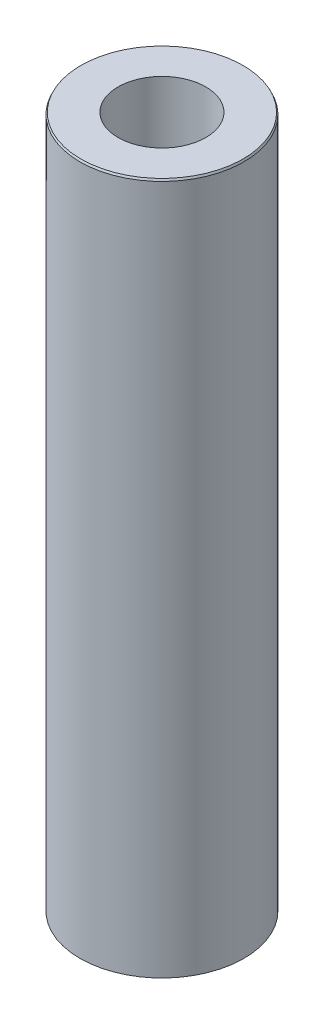
ISO-10303-21;
HEADER;
FILE_DESCRIPTION(('STEP AP214'),'2;1');
FILE_NAME('part.step','',(''),(''),'','','');
FILE_SCHEMA(('AUTOMOTIVE_DESIGN { 1 0 10303 214 1 1 1 1 }'));
ENDSEC;
DATA;
#1=APPLICATION_CONTEXT('core data for automotive mechanical design processes');
#2=APPLICATION_PROTOCOL_DEFINITION('international standard','automotive_design',2000,#1);
#3=PRODUCT_CONTEXT('',#1,'mechanical');
#4=PRODUCT('Part','Part','',(#3));
#5=PRODUCT_RELATED_PRODUCT_CATEGORY('part','',(#4));
#6=PRODUCT_DEFINITION_FORMATION('','',#4);
#7=PRODUCT_DEFINITION_CONTEXT('part definition',#1,'design');
#8=PRODUCT_DEFINITION('design','',#6,#7);
#9=PRODUCT_DEFINITION_SHAPE('','',#8);
#10=(LENGTH_UNIT() NAMED_UNIT(*) SI_UNIT(.MILLI.,.METRE.));
#11=(NAMED_UNIT(*) PLANE_ANGLE_UNIT() SI_UNIT($,.RADIAN.));
#12=(NAMED_UNIT(*) SI_UNIT($,.STERADIAN.) SOLID_ANGLE_UNIT());
#13=UNCERTAINTY_MEASURE_WITH_UNIT(LENGTH_MEASURE(1.E-05),#10,'distance_accuracy_value','');
#14=(GEOMETRIC_REPRESENTATION_CONTEXT(3) GLOBAL_UNCERTAINTY_ASSIGNED_CONTEXT((#13)) GLOBAL_UNIT_ASSIGNED_CONTEXT((#10,
#11,#12)) REPRESENTATION_CONTEXT('',''));
#15=CARTESIAN_POINT('',(0.,0.,0.));
#16=DIRECTION('',(0.,0.,1.));
#17=DIRECTION('',(1.,0.,0.));
#18=AXIS2_PLACEMENT_3D('',#15,#16,#17);
#19=CARTESIAN_POINT('',(0.,506.756488004776,0.));
#20=DIRECTION('',(0.,-1.,0.));
#21=DIRECTION('',(0.,0.,-1.));
#22=AXIS2_PLACEMENT_3D('',#19,#20,#21);
#23=CYLINDRICAL_SURFACE('',#22,60.);
#24=CARTESIAN_POINT('',(0.,505.307668184552,0.));
#25=DIRECTION('',(0.,1.,0.));
#26=DIRECTION('',(0.,0.,1.));
#27=AXIS2_PLACEMENT_3D('',#24,#25,#26);
#28=CIRCLE('',#27,60.);
#29=CARTESIAN_POINT('',(0.,505.307668184552,60.));
#30=VERTEX_POINT('',#29);
#31=EDGE_CURVE('E50',#30,#30,#28,.F.);
#32=ORIENTED_EDGE('',*,*,#31,.T.);
#33=EDGE_LOOP('',(#32));
#34=FACE_BOUND('',#33,.T.);
#35=CARTESIAN_POINT('',(0.,0.67900102171492,0.));
#36=DIRECTION('',(0.,1.,0.));
#37=DIRECTION('',(0.,0.,1.));
#38=AXIS2_PLACEMENT_3D('',#35,#36,#37);
#39=CIRCLE('',#38,60.);
#40=CARTESIAN_POINT('',(0.,0.67900102171492,60.));
#41=VERTEX_POINT('',#40);
#42=EDGE_CURVE('E51',#41,#41,#39,.T.);
#43=ORIENTED_EDGE('',*,*,#42,.T.);
#44=EDGE_LOOP('',(#43));
#45=FACE_BOUND('',#44,.T.);
#46=ADVANCED_FACE('F39',(#34,#45),#23,.T.);
#47=CARTESIAN_POINT('',(0.,506.756488004776,0.));
#48=DIRECTION('',(0.,1.,0.));
#49=DIRECTION('',(0.,0.,1.));
#50=AXIS2_PLACEMENT_3D('',#47,#48,#49);
#51=PLANE('',#50);
#52=CARTESIAN_POINT('',(0.,506.756488004776,0.));
#53=DIRECTION('',(0.,1.,0.));
#54=DIRECTION('',(0.,0.,1.));
#55=AXIS2_PLACEMENT_3D('',#52,#53,#54);
#56=CIRCLE('',#55,59.320998978285);
#57=CARTESIAN_POINT('',(0.,506.756488004776,59.320998978285));
#58=VERTEX_POINT('',#57);
#59=EDGE_CURVE('E54',#58,#58,#56,.T.);
#60=ORIENTED_EDGE('',*,*,#59,.T.);
#61=EDGE_LOOP('',(#60));
#62=FACE_BOUND('',#61,.T.);
#63=CARTESIAN_POINT('',(0.,506.756488004776,0.));
#64=DIRECTION('',(0.,1.,0.));
#65=DIRECTION('',(0.,0.,1.));
#66=AXIS2_PLACEMENT_3D('',#63,#64,#65);
#67=CIRCLE('',#66,32.1069810557419);
#68=CARTESIAN_POINT('',(0.,506.756488004776,32.1069810557419));
#69=VERTEX_POINT('',#68);
#70=EDGE_CURVE('E58',#69,#69,#67,.T.);
#71=ORIENTED_EDGE('',*,*,#70,.F.);
#72=EDGE_LOOP('',(#71));
#73=FACE_BOUND('',#72,.T.);
#74=ADVANCED_FACE('F69',(#62,#73),#51,.T.);
#75=CARTESIAN_POINT('',(0.,0.,0.));
#76=DIRECTION('',(0.,1.,0.));
#77=DIRECTION('',(0.,0.,1.));
#78=AXIS2_PLACEMENT_3D('',#75,#76,#77);
#79=PLANE('',#78);
#80=CARTESIAN_POINT('',(0.,0.,0.));
#81=DIRECTION('',(0.,1.,0.));
#82=DIRECTION('',(0.,0.,1.));
#83=AXIS2_PLACEMENT_3D('',#80,#81,#82);
#84=CIRCLE('',#83,58.5511801797759);
#85=CARTESIAN_POINT('',(0.,0.,58.5511801797759));
#86=VERTEX_POINT('',#85);
#87=EDGE_CURVE('E10',#86,#86,#84,.F.);
#88=ORIENTED_EDGE('',*,*,#87,.T.);
#89=EDGE_LOOP('',(#88));
#90=FACE_BOUND('',#89,.T.);
#91=CARTESIAN_POINT('',(0.,0.,0.));
#92=DIRECTION('',(0.,1.,0.));
#93=DIRECTION('',(0.,0.,1.));
#94=AXIS2_PLACEMENT_3D('',#91,#92,#93);
#95=CIRCLE('',#94,32.1069810557419);
#96=CARTESIAN_POINT('',(0.,0.,32.1069810557419));
#97=VERTEX_POINT('',#96);
#98=EDGE_CURVE('E63',#97,#97,#95,.T.);
#99=ORIENTED_EDGE('',*,*,#98,.T.);
#100=EDGE_LOOP('',(#99));
#101=FACE_BOUND('',#100,.T.);
#102=ADVANCED_FACE('F75',(#90,#101),#79,.F.);
#103=CARTESIAN_POINT('',(0.,506.756488004776,0.));
#104=DIRECTION('',(0.,-1.,0.));
#105=DIRECTION('',(0.,0.,-1.));
#106=AXIS2_PLACEMENT_3D('',#103,#104,#105);
#107=CYLINDRICAL_SURFACE('',#106,32.1069810557419);
#108=ORIENTED_EDGE('',*,*,#70,.T.);
#109=EDGE_LOOP('',(#108));
#110=FACE_BOUND('',#109,.T.);
#111=ORIENTED_EDGE('',*,*,#98,.F.);
#112=EDGE_LOOP('',(#111));
#113=FACE_BOUND('',#112,.T.);
#114=ADVANCED_FACE('F70',(#110,#113),#107,.F.);
#115=CARTESIAN_POINT('',(0.,506.756488004776,0.));
#116=DIRECTION('',(0.,-1.,0.));
#117=DIRECTION('',(0.,0.,-1.));
#118=AXIS2_PLACEMENT_3D('',#115,#116,#117);
#119=CONICAL_SURFACE('',#118,59.320998978285,0.438261143131141);
#120=ORIENTED_EDGE('',*,*,#31,.F.);
#121=EDGE_LOOP('',(#120));
#122=FACE_BOUND('',#121,.T.);
#123=ORIENTED_EDGE('',*,*,#59,.F.);
#124=EDGE_LOOP('',(#123));
#125=FACE_BOUND('',#124,.T.);
#126=ADVANCED_FACE('F81',(#122,#125),#119,.T.);
#127=CARTESIAN_POINT('',(0.,0.67900102171492,0.));
#128=DIRECTION('',(0.,1.,0.));
#129=DIRECTION('',(0.,0.,1.));
#130=AXIS2_PLACEMENT_3D('',#127,#128,#129);
#131=CONICAL_SURFACE('',#130,60.,1.13253518366381);
#132=ORIENTED_EDGE('',*,*,#87,.F.);
#133=EDGE_LOOP('',(#132));
#134=FACE_BOUND('',#133,.T.);
#135=ORIENTED_EDGE('',*,*,#42,.F.);
#136=EDGE_LOOP('',(#135));
#137=FACE_BOUND('',#136,.T.);
#138=ADVANCED_FACE('F45',(#134,#137),#131,.T.);
#139=CLOSED_SHELL('',(#46,#74,#102,#114,#126,#138));
#140=MANIFOLD_SOLID_BREP('B2',#139);
#141=ADVANCED_BREP_SHAPE_REPRESENTATION('',(#18,#140),#14);
#142=SHAPE_DEFINITION_REPRESENTATION(#9,#141);
ENDSEC;
END-ISO-10303-21;
